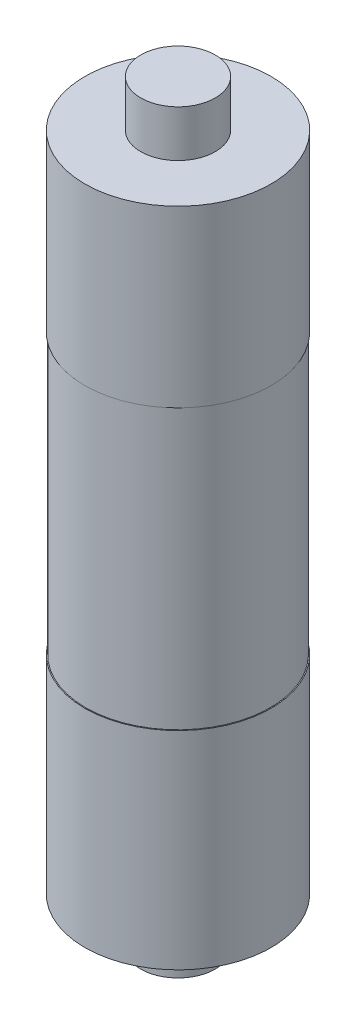
ISO-10303-21;
HEADER;
FILE_DESCRIPTION(('STEP AP214'),'2;1');
FILE_NAME('part.step','',(''),(''),'','','');
FILE_SCHEMA(('AUTOMOTIVE_DESIGN { 1 0 10303 214 1 1 1 1 }'));
ENDSEC;
DATA;
#1=APPLICATION_CONTEXT('core data for automotive mechanical design processes');
#2=APPLICATION_PROTOCOL_DEFINITION('international standard','automotive_design',2000,#1);
#3=PRODUCT_CONTEXT('',#1,'mechanical');
#4=PRODUCT('Part','Part','',(#3));
#5=PRODUCT_RELATED_PRODUCT_CATEGORY('part','',(#4));
#6=PRODUCT_DEFINITION_FORMATION('','',#4);
#7=PRODUCT_DEFINITION_CONTEXT('part definition',#1,'design');
#8=PRODUCT_DEFINITION('design','',#6,#7);
#9=PRODUCT_DEFINITION_SHAPE('','',#8);
#10=(LENGTH_UNIT() NAMED_UNIT(*) SI_UNIT(.MILLI.,.METRE.));
#11=(NAMED_UNIT(*) PLANE_ANGLE_UNIT() SI_UNIT($,.RADIAN.));
#12=(NAMED_UNIT(*) SI_UNIT($,.STERADIAN.) SOLID_ANGLE_UNIT());
#13=UNCERTAINTY_MEASURE_WITH_UNIT(LENGTH_MEASURE(1.E-05),#10,'distance_accuracy_value','');
#14=(GEOMETRIC_REPRESENTATION_CONTEXT(3) GLOBAL_UNCERTAINTY_ASSIGNED_CONTEXT((#13)) GLOBAL_UNIT_ASSIGNED_CONTEXT((#10,
#11,#12)) REPRESENTATION_CONTEXT('',''));
#15=CARTESIAN_POINT('',(0.,0.,0.));
#16=DIRECTION('',(0.,0.,1.));
#17=DIRECTION('',(1.,0.,0.));
#18=AXIS2_PLACEMENT_3D('',#15,#16,#17);
#19=CARTESIAN_POINT('',(0.,71.,0.));
#20=DIRECTION('',(0.,-1.,0.));
#21=DIRECTION('',(0.,0.,-1.));
#22=AXIS2_PLACEMENT_3D('',#19,#20,#21);
#23=CYLINDRICAL_SURFACE('',#22,10.);
#24=CARTESIAN_POINT('',(0.,71.,0.));
#25=DIRECTION('',(0.,1.,0.));
#26=DIRECTION('',(0.,0.,1.));
#27=AXIS2_PLACEMENT_3D('',#24,#25,#26);
#28=CIRCLE('',#27,10.);
#29=CARTESIAN_POINT('',(0.,71.,10.));
#30=VERTEX_POINT('',#29);
#31=EDGE_CURVE('E37',#30,#30,#28,.T.);
#32=ORIENTED_EDGE('',*,*,#31,.F.);
#33=EDGE_LOOP('',(#32));
#34=FACE_BOUND('',#33,.T.);
#35=CARTESIAN_POINT('',(0.,52.25,0.));
#36=DIRECTION('',(0.,1.,0.));
#37=DIRECTION('',(0.,0.,1.));
#38=AXIS2_PLACEMENT_3D('',#35,#36,#37);
#39=CIRCLE('',#38,9.99999999999998);
#40=CARTESIAN_POINT('',(0.,52.25,9.99999999999998));
#41=VERTEX_POINT('',#40);
#42=EDGE_CURVE('E46',#41,#41,#39,.T.);
#43=ORIENTED_EDGE('',*,*,#42,.T.);
#44=EDGE_LOOP('',(#43));
#45=FACE_BOUND('',#44,.T.);
#46=ADVANCED_FACE('F31',(#34,#45),#23,.T.);
#47=CARTESIAN_POINT('',(0.,71.,0.));
#48=DIRECTION('',(0.,1.,0.));
#49=DIRECTION('',(0.,0.,1.));
#50=AXIS2_PLACEMENT_3D('',#47,#48,#49);
#51=PLANE('',#50);
#52=CARTESIAN_POINT('',(0.,71.,0.));
#53=DIRECTION('',(0.,1.,0.));
#54=DIRECTION('',(0.,0.,1.));
#55=AXIS2_PLACEMENT_3D('',#52,#53,#54);
#56=CIRCLE('',#55,4.);
#57=CARTESIAN_POINT('',(0.,71.,4.));
#58=VERTEX_POINT('',#57);
#59=EDGE_CURVE('E63',#58,#58,#56,.T.);
#60=ORIENTED_EDGE('',*,*,#59,.F.);
#61=EDGE_LOOP('',(#60));
#62=FACE_BOUND('',#61,.T.);
#63=ORIENTED_EDGE('',*,*,#31,.T.);
#64=EDGE_LOOP('',(#63));
#65=FACE_BOUND('',#64,.T.);
#66=ADVANCED_FACE('F78',(#62,#65),#51,.T.);
#67=CARTESIAN_POINT('',(0.,52.25,-9.99999999999998));
#68=DIRECTION('',(0.,-1.,0.));
#69=DIRECTION('',(0.,0.,-1.));
#70=AXIS2_PLACEMENT_3D('',#67,#68,#69);
#71=PLANE('',#70);
#72=CARTESIAN_POINT('',(0.,52.25,0.));
#73=DIRECTION('',(0.,1.,0.));
#74=DIRECTION('',(0.,0.,1.));
#75=AXIS2_PLACEMENT_3D('',#72,#73,#74);
#76=CIRCLE('',#75,9.9);
#77=CARTESIAN_POINT('',(0.,52.25,9.9));
#78=VERTEX_POINT('',#77);
#79=EDGE_CURVE('E50',#78,#78,#76,.T.);
#80=ORIENTED_EDGE('',*,*,#79,.T.);
#81=EDGE_LOOP('',(#80));
#82=FACE_BOUND('',#81,.T.);
#83=ORIENTED_EDGE('',*,*,#42,.F.);
#84=EDGE_LOOP('',(#83));
#85=FACE_BOUND('',#84,.T.);
#86=ADVANCED_FACE('F80',(#82,#85),#71,.T.);
#87=CARTESIAN_POINT('',(0.,71.,0.));
#88=DIRECTION('',(0.,1.,0.));
#89=DIRECTION('',(0.,0.,1.));
#90=AXIS2_PLACEMENT_3D('',#87,#88,#89);
#91=CYLINDRICAL_SURFACE('',#90,9.9);
#92=CARTESIAN_POINT('',(0.,22.25,0.));
#93=DIRECTION('',(0.,1.,0.));
#94=DIRECTION('',(0.,0.,1.));
#95=AXIS2_PLACEMENT_3D('',#92,#93,#94);
#96=CIRCLE('',#95,9.9);
#97=CARTESIAN_POINT('',(0.,22.25,9.9));
#98=VERTEX_POINT('',#97);
#99=EDGE_CURVE('E53',#98,#98,#96,.T.);
#100=ORIENTED_EDGE('',*,*,#99,.T.);
#101=EDGE_LOOP('',(#100));
#102=FACE_BOUND('',#101,.T.);
#103=ORIENTED_EDGE('',*,*,#79,.F.);
#104=EDGE_LOOP('',(#103));
#105=FACE_BOUND('',#104,.T.);
#106=ADVANCED_FACE('F86',(#102,#105),#91,.T.);
#107=CARTESIAN_POINT('',(0.,22.25,-10.));
#108=DIRECTION('',(0.,1.,0.));
#109=DIRECTION('',(0.,0.,1.));
#110=AXIS2_PLACEMENT_3D('',#107,#108,#109);
#111=PLANE('',#110);
#112=CARTESIAN_POINT('',(0.,22.25,0.));
#113=DIRECTION('',(0.,1.,0.));
#114=DIRECTION('',(0.,0.,1.));
#115=AXIS2_PLACEMENT_3D('',#112,#113,#114);
#116=CIRCLE('',#115,10.);
#117=CARTESIAN_POINT('',(0.,22.25,10.));
#118=VERTEX_POINT('',#117);
#119=EDGE_CURVE('E56',#118,#118,#116,.T.);
#120=ORIENTED_EDGE('',*,*,#119,.T.);
#121=EDGE_LOOP('',(#120));
#122=FACE_BOUND('',#121,.T.);
#123=ORIENTED_EDGE('',*,*,#99,.F.);
#124=EDGE_LOOP('',(#123));
#125=FACE_BOUND('',#124,.T.);
#126=ADVANCED_FACE('F94',(#122,#125),#111,.T.);
#127=CARTESIAN_POINT('',(0.,0.,0.));
#128=DIRECTION('',(0.,1.,0.));
#129=DIRECTION('',(0.,0.,1.));
#130=AXIS2_PLACEMENT_3D('',#127,#128,#129);
#131=PLANE('',#130);
#132=CARTESIAN_POINT('',(0.,0.,0.));
#133=DIRECTION('',(0.,1.,0.));
#134=DIRECTION('',(0.,0.,1.));
#135=AXIS2_PLACEMENT_3D('',#132,#133,#134);
#136=CIRCLE('',#135,4.);
#137=CARTESIAN_POINT('',(0.,0.,4.));
#138=VERTEX_POINT('',#137);
#139=EDGE_CURVE('E10',#138,#138,#136,.F.);
#140=ORIENTED_EDGE('',*,*,#139,.F.);
#141=EDGE_LOOP('',(#140));
#142=FACE_BOUND('',#141,.T.);
#143=CARTESIAN_POINT('',(0.,0.,0.));
#144=DIRECTION('',(0.,1.,0.));
#145=DIRECTION('',(0.,0.,1.));
#146=AXIS2_PLACEMENT_3D('',#143,#144,#145);
#147=CIRCLE('',#146,10.);
#148=CARTESIAN_POINT('',(0.,0.,10.));
#149=VERTEX_POINT('',#148);
#150=EDGE_CURVE('E41',#149,#149,#147,.T.);
#151=ORIENTED_EDGE('',*,*,#150,.F.);
#152=EDGE_LOOP('',(#151));
#153=FACE_BOUND('',#152,.T.);
#154=ADVANCED_FACE('F92',(#142,#153),#131,.F.);
#155=ORIENTED_EDGE('',*,*,#150,.T.);
#156=EDGE_LOOP('',(#155));
#157=FACE_BOUND('',#156,.T.);
#158=ORIENTED_EDGE('',*,*,#119,.F.);
#159=EDGE_LOOP('',(#158));
#160=FACE_BOUND('',#159,.T.);
#161=ADVANCED_FACE('F90',(#157,#160),#23,.T.);
#162=CARTESIAN_POINT('',(0.,-5.,0.));
#163=DIRECTION('',(0.,1.,0.));
#164=DIRECTION('',(0.,0.,1.));
#165=AXIS2_PLACEMENT_3D('',#162,#163,#164);
#166=CYLINDRICAL_SURFACE('',#165,4.);
#167=CARTESIAN_POINT('',(0.,-5.,0.));
#168=DIRECTION('',(0.,-1.,0.));
#169=DIRECTION('',(0.,0.,-1.));
#170=AXIS2_PLACEMENT_3D('',#167,#168,#169);
#171=CIRCLE('',#170,4.);
#172=CARTESIAN_POINT('',(0.,-5.,-4.));
#173=VERTEX_POINT('',#172);
#174=EDGE_CURVE('E59',#173,#173,#171,.T.);
#175=ORIENTED_EDGE('',*,*,#174,.F.);
#176=EDGE_LOOP('',(#175));
#177=FACE_BOUND('',#176,.T.);
#178=ORIENTED_EDGE('',*,*,#139,.T.);
#179=EDGE_LOOP('',(#178));
#180=FACE_BOUND('',#179,.T.);
#181=ADVANCED_FACE('F100',(#177,#180),#166,.T.);
#182=CARTESIAN_POINT('',(0.,-5.,0.));
#183=DIRECTION('',(0.,-1.,0.));
#184=DIRECTION('',(0.,0.,-1.));
#185=AXIS2_PLACEMENT_3D('',#182,#183,#184);
#186=PLANE('',#185);
#187=ORIENTED_EDGE('',*,*,#174,.T.);
#188=EDGE_LOOP('',(#187));
#189=FACE_BOUND('',#188,.T.);
#190=ADVANCED_FACE('F74',(#189),#186,.T.);
#191=CARTESIAN_POINT('',(0.,76.,0.));
#192=DIRECTION('',(0.,-1.,0.));
#193=DIRECTION('',(0.,0.,-1.));
#194=AXIS2_PLACEMENT_3D('',#191,#192,#193);
#195=CYLINDRICAL_SURFACE('',#194,4.);
#196=CARTESIAN_POINT('',(0.,76.,0.));
#197=DIRECTION('',(0.,1.,0.));
#198=DIRECTION('',(0.,0.,1.));
#199=AXIS2_PLACEMENT_3D('',#196,#197,#198);
#200=CIRCLE('',#199,4.);
#201=CARTESIAN_POINT('',(0.,76.,4.));
#202=VERTEX_POINT('',#201);
#203=EDGE_CURVE('E62',#202,#202,#200,.T.);
#204=ORIENTED_EDGE('',*,*,#203,.F.);
#205=EDGE_LOOP('',(#204));
#206=FACE_BOUND('',#205,.T.);
#207=ORIENTED_EDGE('',*,*,#59,.T.);
#208=EDGE_LOOP('',(#207));
#209=FACE_BOUND('',#208,.T.);
#210=ADVANCED_FACE('F71',(#206,#209),#195,.T.);
#211=CARTESIAN_POINT('',(0.,76.,0.));
#212=DIRECTION('',(0.,1.,0.));
#213=DIRECTION('',(0.,0.,1.));
#214=AXIS2_PLACEMENT_3D('',#211,#212,#213);
#215=PLANE('',#214);
#216=ORIENTED_EDGE('',*,*,#203,.T.);
#217=EDGE_LOOP('',(#216));
#218=FACE_BOUND('',#217,.T.);
#219=ADVANCED_FACE('F69',(#218),#215,.T.);
#220=CLOSED_SHELL('',(#46,#66,#86,#106,#126,#154,#161,#181,#190,#210,#219));
#221=MANIFOLD_SOLID_BREP('B2',#220);
#222=ADVANCED_BREP_SHAPE_REPRESENTATION('',(#18,#221),#14);
#223=SHAPE_DEFINITION_REPRESENTATION(#9,#222);
ENDSEC;
END-ISO-10303-21;
